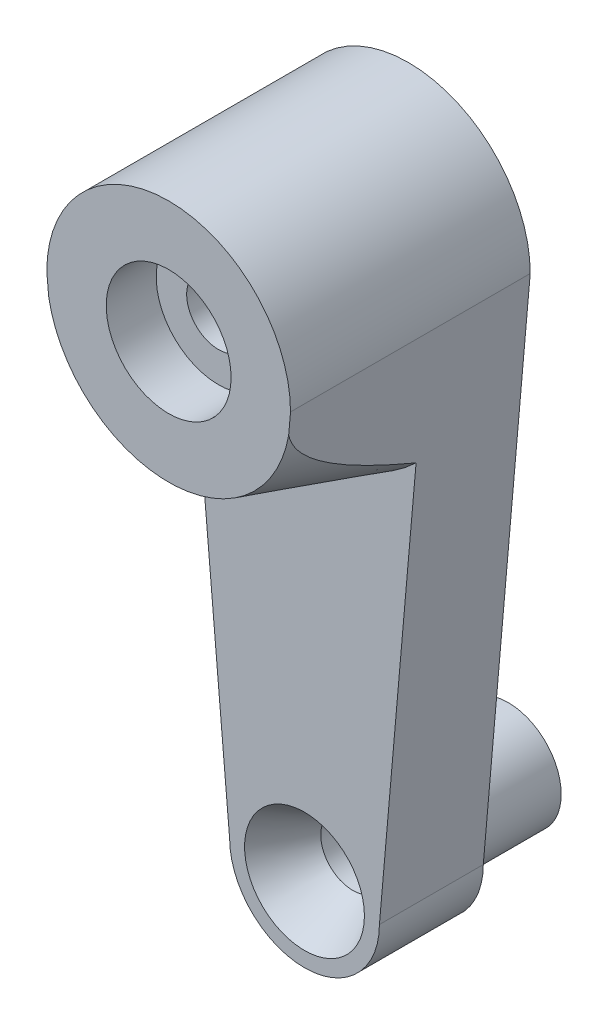
ISO-10303-21;
HEADER;
FILE_DESCRIPTION(('STEP AP214'),'2;1');
FILE_NAME('part.step','',(''),(''),'','','');
FILE_SCHEMA(('AUTOMOTIVE_DESIGN { 1 0 10303 214 1 1 1 1 }'));
ENDSEC;
DATA;
#1=APPLICATION_CONTEXT('core data for automotive mechanical design processes');
#2=APPLICATION_PROTOCOL_DEFINITION('international standard','automotive_design',2000,#1);
#3=PRODUCT_CONTEXT('',#1,'mechanical');
#4=PRODUCT('Part','Part','',(#3));
#5=PRODUCT_RELATED_PRODUCT_CATEGORY('part','',(#4));
#6=PRODUCT_DEFINITION_FORMATION('','',#4);
#7=PRODUCT_DEFINITION_CONTEXT('part definition',#1,'design');
#8=PRODUCT_DEFINITION('design','',#6,#7);
#9=PRODUCT_DEFINITION_SHAPE('','',#8);
#10=(LENGTH_UNIT() NAMED_UNIT(*) SI_UNIT(.MILLI.,.METRE.));
#11=(NAMED_UNIT(*) PLANE_ANGLE_UNIT() SI_UNIT($,.RADIAN.));
#12=(NAMED_UNIT(*) SI_UNIT($,.STERADIAN.) SOLID_ANGLE_UNIT());
#13=UNCERTAINTY_MEASURE_WITH_UNIT(LENGTH_MEASURE(1.E-05),#10,'distance_accuracy_value','');
#14=(GEOMETRIC_REPRESENTATION_CONTEXT(3) GLOBAL_UNCERTAINTY_ASSIGNED_CONTEXT((#13)) GLOBAL_UNIT_ASSIGNED_CONTEXT((#10,
#11,#12)) REPRESENTATION_CONTEXT('',''));
#15=CARTESIAN_POINT('',(0.,0.,0.));
#16=DIRECTION('',(0.,0.,1.));
#17=DIRECTION('',(1.,0.,0.));
#18=AXIS2_PLACEMENT_3D('',#15,#16,#17);
#19=CARTESIAN_POINT('',(0.,0.,12.));
#20=DIRECTION('',(0.,0.,-1.));
#21=DIRECTION('',(-1.,0.,0.));
#22=AXIS2_PLACEMENT_3D('',#19,#20,#21);
#23=CYLINDRICAL_SURFACE('',#22,1.6);
#24=CARTESIAN_POINT('',(0.,0.,2.5));
#25=DIRECTION('',(0.,0.,-1.));
#26=DIRECTION('',(-1.,0.,0.));
#27=AXIS2_PLACEMENT_3D('',#24,#25,#26);
#28=CIRCLE('',#27,1.6);
#29=CARTESIAN_POINT('',(-1.6,0.,2.5));
#30=VERTEX_POINT('',#29);
#31=EDGE_CURVE('E39',#30,#30,#28,.T.);
#32=ORIENTED_EDGE('',*,*,#31,.T.);
#33=EDGE_LOOP('',(#32));
#34=FACE_BOUND('',#33,.T.);
#35=CARTESIAN_POINT('',(0.,0.,9.5));
#36=DIRECTION('',(0.,0.,1.));
#37=DIRECTION('',(1.,0.,0.));
#38=AXIS2_PLACEMENT_3D('',#35,#36,#37);
#39=CIRCLE('',#38,1.6);
#40=CARTESIAN_POINT('',(1.6,0.,9.5));
#41=VERTEX_POINT('',#40);
#42=EDGE_CURVE('E229',#41,#41,#39,.T.);
#43=ORIENTED_EDGE('',*,*,#42,.T.);
#44=EDGE_LOOP('',(#43));
#45=FACE_BOUND('',#44,.T.);
#46=ADVANCED_FACE('F34',(#34,#45),#23,.F.);
#47=CARTESIAN_POINT('',(0.,-26.8,12.));
#48=DIRECTION('',(0.,0.,-1.));
#49=DIRECTION('',(-1.,0.,0.));
#50=AXIS2_PLACEMENT_3D('',#47,#48,#49);
#51=CYLINDRICAL_SURFACE('',#50,3.75);
#52=CARTESIAN_POINT('',(0.,-26.8,5.2));
#53=DIRECTION('',(0.,0.,1.));
#54=DIRECTION('',(1.,0.,0.));
#55=AXIS2_PLACEMENT_3D('',#52,#53,#54);
#56=CIRCLE('',#55,3.75);
#57=CARTESIAN_POINT('',(-3.75,-26.8,5.2));
#58=VERTEX_POINT('',#57);
#59=CARTESIAN_POINT('',(3.75,-26.8,5.2));
#60=VERTEX_POINT('',#59);
#61=EDGE_CURVE('E91',#58,#60,#56,.T.);
#62=ORIENTED_EDGE('',*,*,#61,.F.);
#63=DIRECTION('',(0.,0.,-1.));
#64=VECTOR('',#63,1.);
#65=CARTESIAN_POINT('',(-3.75,-26.8,12.));
#66=LINE('',#65,#64);
#67=CARTESIAN_POINT('',(-3.75,-26.8,0.));
#68=VERTEX_POINT('',#67);
#69=EDGE_CURVE('E101',#58,#68,#66,.T.);
#70=ORIENTED_EDGE('',*,*,#69,.T.);
#71=CARTESIAN_POINT('',(0.,-26.8,0.));
#72=DIRECTION('',(0.,0.,1.));
#73=DIRECTION('',(1.,0.,0.));
#74=AXIS2_PLACEMENT_3D('',#71,#72,#73);
#75=CIRCLE('',#74,3.75);
#76=CARTESIAN_POINT('',(3.75,-26.8,0.));
#77=VERTEX_POINT('',#76);
#78=EDGE_CURVE('E203',#68,#77,#75,.T.);
#79=ORIENTED_EDGE('',*,*,#78,.T.);
#80=DIRECTION('',(0.,0.,-1.));
#81=VECTOR('',#80,1.);
#82=CARTESIAN_POINT('',(3.75,-26.8,12.));
#83=LINE('',#82,#81);
#84=EDGE_CURVE('E103',#60,#77,#83,.T.);
#85=ORIENTED_EDGE('',*,*,#84,.F.);
#86=EDGE_LOOP('',(#62,#70,#79,#85));
#87=FACE_BOUND('',#86,.T.);
#88=ADVANCED_FACE('F99',(#87),#51,.T.);
#89=CARTESIAN_POINT('',(0.,-26.8,12.));
#90=DIRECTION('',(0.,0.,-1.));
#91=DIRECTION('',(-1.,0.,0.));
#92=AXIS2_PLACEMENT_3D('',#89,#90,#91);
#93=CYLINDRICAL_SURFACE('',#92,1.6);
#94=CARTESIAN_POINT('',(0.,-26.8,2.78620689655173));
#95=DIRECTION('',(0.,0.,1.));
#96=DIRECTION('',(1.,0.,0.));
#97=AXIS2_PLACEMENT_3D('',#94,#95,#96);
#98=CIRCLE('',#97,1.6);
#99=CARTESIAN_POINT('',(1.6,-26.8,2.78620689655173));
#100=VERTEX_POINT('',#99);
#101=EDGE_CURVE('E234',#100,#100,#98,.F.);
#102=ORIENTED_EDGE('',*,*,#101,.F.);
#103=EDGE_LOOP('',(#102));
#104=FACE_BOUND('',#103,.T.);
#105=CARTESIAN_POINT('',(0.,-26.8,0.));
#106=DIRECTION('',(0.,0.,1.));
#107=DIRECTION('',(1.,0.,0.));
#108=AXIS2_PLACEMENT_3D('',#105,#106,#107);
#109=CIRCLE('',#108,1.6);
#110=CARTESIAN_POINT('',(1.6,-26.8,0.));
#111=VERTEX_POINT('',#110);
#112=EDGE_CURVE('E201',#111,#111,#109,.T.);
#113=ORIENTED_EDGE('',*,*,#112,.F.);
#114=EDGE_LOOP('',(#113));
#115=FACE_BOUND('',#114,.T.);
#116=ADVANCED_FACE('F154',(#104,#115),#93,.F.);
#117=CARTESIAN_POINT('',(0.,-26.8,12.));
#118=DIRECTION('',(0.,0.,1.));
#119=DIRECTION('',(1.,0.,0.));
#120=AXIS2_PLACEMENT_3D('',#117,#118,#119);
#121=PLANE('',#120);
#122=CARTESIAN_POINT('',(0.,0.,12.));
#123=DIRECTION('',(0.,0.,1.));
#124=DIRECTION('',(1.,0.,0.));
#125=AXIS2_PLACEMENT_3D('',#122,#123,#124);
#126=CIRCLE('',#125,3.125);
#127=CARTESIAN_POINT('',(3.125,0.,12.));
#128=VERTEX_POINT('',#127);
#129=EDGE_CURVE('E190',#128,#128,#126,.T.);
#130=ORIENTED_EDGE('',*,*,#129,.F.);
#131=EDGE_LOOP('',(#130));
#132=FACE_BOUND('',#131,.T.);
#133=CARTESIAN_POINT('',(0.,0.,12.));
#134=DIRECTION('',(0.,0.,-1.));
#135=DIRECTION('',(1.,0.,0.));
#136=AXIS2_PLACEMENT_3D('',#133,#134,#135);
#137=CIRCLE('',#136,6.1);
#138=CARTESIAN_POINT('',(6.00691076147217,-1.06161344363654,12.));
#139=VERTEX_POINT('',#138);
#140=CARTESIAN_POINT('',(-6.00691076147216,-1.06161344363656,12.));
#141=VERTEX_POINT('',#140);
#142=EDGE_CURVE('E95',#139,#141,#137,.T.);
#143=ORIENTED_EDGE('',*,*,#142,.F.);
#144=DIRECTION('',(0.0873513906763996,0.996177561756386,0.));
#145=VECTOR('',#144,1.);
#146=CARTESIAN_POINT('',(6.1,0.,12.));
#147=LINE('',#146,#145);
#148=CARTESIAN_POINT('',(6.1,0.,12.));
#149=VERTEX_POINT('',#148);
#150=EDGE_CURVE('E191',#139,#149,#147,.T.);
#151=ORIENTED_EDGE('',*,*,#150,.T.);
#152=CARTESIAN_POINT('',(0.,0.,12.));
#153=DIRECTION('',(0.,0.,1.));
#154=DIRECTION('',(1.,0.,0.));
#155=AXIS2_PLACEMENT_3D('',#152,#153,#154);
#156=CIRCLE('',#155,6.1);
#157=CARTESIAN_POINT('',(-6.1,0.,12.));
#158=VERTEX_POINT('',#157);
#159=EDGE_CURVE('E117',#149,#158,#156,.T.);
#160=ORIENTED_EDGE('',*,*,#159,.T.);
#161=DIRECTION('',(0.0873513906763996,-0.996177561756386,0.));
#162=VECTOR('',#161,1.);
#163=CARTESIAN_POINT('',(-3.75,-26.8,12.));
#164=LINE('',#163,#162);
#165=EDGE_CURVE('E112',#158,#141,#164,.T.);
#166=ORIENTED_EDGE('',*,*,#165,.T.);
#167=EDGE_LOOP('',(#143,#151,#160,#166));
#168=FACE_BOUND('',#167,.T.);
#169=ADVANCED_FACE('F178',(#132,#168),#121,.T.);
#170=CARTESIAN_POINT('',(0.,-26.8,0.));
#171=DIRECTION('',(0.,0.,1.));
#172=DIRECTION('',(1.,0.,0.));
#173=AXIS2_PLACEMENT_3D('',#170,#171,#172);
#174=PLANE('',#173);
#175=CARTESIAN_POINT('',(0.,0.,0.));
#176=DIRECTION('',(0.,0.,-1.));
#177=DIRECTION('',(-1.,0.,0.));
#178=AXIS2_PLACEMENT_3D('',#175,#176,#177);
#179=CIRCLE('',#178,3.125);
#180=CARTESIAN_POINT('',(-3.125,0.,0.));
#181=VERTEX_POINT('',#180);
#182=EDGE_CURVE('E221',#181,#181,#179,.T.);
#183=ORIENTED_EDGE('',*,*,#182,.F.);
#184=EDGE_LOOP('',(#183));
#185=FACE_BOUND('',#184,.T.);
#186=CARTESIAN_POINT('',(0.,-26.8,0.));
#187=DIRECTION('',(0.,0.,1.));
#188=DIRECTION('',(1.,0.,0.));
#189=AXIS2_PLACEMENT_3D('',#186,#187,#188);
#190=CIRCLE('',#189,3.15);
#191=CARTESIAN_POINT('',(3.15,-26.8,0.));
#192=VERTEX_POINT('',#191);
#193=EDGE_CURVE('E128',#192,#192,#190,.T.);
#194=ORIENTED_EDGE('',*,*,#193,.T.);
#195=EDGE_LOOP('',(#194));
#196=FACE_BOUND('',#195,.T.);
#197=ORIENTED_EDGE('',*,*,#78,.F.);
#198=DIRECTION('',(0.0873513906763996,-0.996177561756386,0.));
#199=VECTOR('',#198,1.);
#200=CARTESIAN_POINT('',(-3.75,-26.8,0.));
#201=LINE('',#200,#199);
#202=CARTESIAN_POINT('',(-6.1,0.,0.));
#203=VERTEX_POINT('',#202);
#204=EDGE_CURVE('E109',#203,#68,#201,.T.);
#205=ORIENTED_EDGE('',*,*,#204,.F.);
#206=CARTESIAN_POINT('',(0.,0.,0.));
#207=DIRECTION('',(0.,0.,1.));
#208=DIRECTION('',(1.,0.,0.));
#209=AXIS2_PLACEMENT_3D('',#206,#207,#208);
#210=CIRCLE('',#209,6.1);
#211=CARTESIAN_POINT('',(6.1,0.,0.));
#212=VERTEX_POINT('',#211);
#213=EDGE_CURVE('E199',#212,#203,#210,.T.);
#214=ORIENTED_EDGE('',*,*,#213,.F.);
#215=DIRECTION('',(0.0873513906763996,0.996177561756386,0.));
#216=VECTOR('',#215,1.);
#217=CARTESIAN_POINT('',(6.1,0.,0.));
#218=LINE('',#217,#216);
#219=EDGE_CURVE('E205',#77,#212,#218,.T.);
#220=ORIENTED_EDGE('',*,*,#219,.F.);
#221=EDGE_LOOP('',(#197,#205,#214,#220));
#222=FACE_BOUND('',#221,.T.);
#223=ADVANCED_FACE('F145',(#185,#196,#222),#174,.F.);
#224=CARTESIAN_POINT('',(6.1,0.,12.));
#225=DIRECTION('',(-0.996177561756386,0.0873513906763996,0.));
#226=DIRECTION('',(-0.0873513906763996,-0.996177561756386,0.));
#227=AXIS2_PLACEMENT_3D('',#224,#225,#226);
#228=PLANE('',#227);
#229=ORIENTED_EDGE('',*,*,#150,.F.);
#230=CARTESIAN_POINT('',(6.00691076147217,-1.06161344363654,11.9999999999999));
#231=CARTESIAN_POINT('',(5.99959290657591,-1.14506812926192,11.9751362120785));
#232=CARTESIAN_POINT('',(5.99243235980993,-1.22672883280593,11.9449550579355));
#233=CARTESIAN_POINT('',(5.97847258999629,-1.38592961195724,11.8758799471729));
#234=CARTESIAN_POINT('',(5.9716719683851,-1.4634856371401,11.8370233346673));
#235=CARTESIAN_POINT('',(5.95206059900039,-1.68713870076145,11.7116434654855));
#236=CARTESIAN_POINT('',(5.93974067235911,-1.8276382896918,11.6151440803783));
#237=CARTESIAN_POINT('',(5.91544789226449,-2.10467935630285,11.3977095441892));
#238=CARTESIAN_POINT('',(5.90356521581586,-2.24019243239791,11.2755087663683));
#239=CARTESIAN_POINT('',(5.88086373731854,-2.49908588930344,11.0186654610849));
#240=CARTESIAN_POINT('',(5.87004637830578,-2.6224498133639,10.8840065241381));
#241=CARTESIAN_POINT('',(5.84895494164729,-2.86298194206493,10.6024445651832));
#242=CARTESIAN_POINT('',(5.83870594811579,-2.97986408106249,10.4552988427259));
#243=CARTESIAN_POINT('',(5.81891825837843,-3.20552794700341,10.155098552462));
#244=CARTESIAN_POINT('',(5.80937907159271,-3.31431526864486,10.0020481788366));
#245=CARTESIAN_POINT('',(5.7887895818787,-3.54912306623438,9.65686973716202));
#246=CARTESIAN_POINT('',(5.77787859154305,-3.67355478580692,9.46365880553206));
#247=CARTESIAN_POINT('',(5.75670729540617,-3.91499765238915,9.07259651436448));
#248=CARTESIAN_POINT('',(5.74644714893255,-4.03200698238626,8.87474403468242));
#249=CARTESIAN_POINT('',(5.72643438988905,-4.2602375961589,8.47533693525278));
#250=CARTESIAN_POINT('',(5.71668253596197,-4.3714502281784,8.27377735671162));
#251=CARTESIAN_POINT('',(5.69760506355262,-4.58901459437861,7.8680295003107));
#252=CARTESIAN_POINT('',(5.68827946630312,-4.69536608641544,7.66384109215117));
#253=CARTESIAN_POINT('',(5.6708452773313,-4.89419002873235,7.27275622565567));
#254=CARTESIAN_POINT('',(5.66270485526182,-4.9870254804184,7.08604509495847));
#255=CARTESIAN_POINT('',(5.64667240975651,-5.16986358235131,6.71122496150825));
#256=CARTESIAN_POINT('',(5.63878039452783,-5.2598661390017,6.52311591282248));
#257=CARTESIAN_POINT('',(5.62323767587374,-5.43711927088674,6.14638500444435));
#258=CARTESIAN_POINT('',(5.61558623934931,-5.5243782065696,5.95776709992486));
#259=CARTESIAN_POINT('',(5.60047114905192,-5.69675455549296,5.57956788235996));
#260=CARTESIAN_POINT('',(5.59300747820272,-5.7818721634754,5.38998665882174));
#261=CARTESIAN_POINT('',(5.58562427825302,-5.86607206077406,5.20000000000024));
#262=B_SPLINE_CURVE_WITH_KNOTS('',3,(#230,#231,#232,#233,#234,#235,#236,#237,#238,#239,#240,
#241,#242,#243,#244,#245,#246,#247,#248,#249,#250,#251,#252,#253,#254,#255,#256,#257,#258,#259,
#260,#261),.UNSPECIFIED.,.F.,.F.,(4,2,2,2,2,2,2,2,2,2,2,2,2,2,2,4),(0.,0.261662991599173,
0.52222063880498,1.03265787208609,1.58016338965039,2.12840061963556,2.69264497011371,
3.25649565177873,3.94647814488238,4.63662890007614,5.32778184670856,6.01896918372795,
6.64497054759159,7.27099257234815,7.89487319806591,8.51869687865688),.UNSPECIFIED.);
#263=CARTESIAN_POINT('',(5.58562427825305,-5.8660720607737,5.2));
#264=VERTEX_POINT('',#263);
#265=EDGE_CURVE('E11',#139,#264,#262,.T.);
#266=ORIENTED_EDGE('',*,*,#265,.T.);
#267=DIRECTION('',(0.0873513906763995,0.996177561756386,0.));
#268=VECTOR('',#267,1.);
#269=CARTESIAN_POINT('',(3.75,-26.8,5.2));
#270=LINE('',#269,#268);
#271=EDGE_CURVE('E104',#60,#264,#270,.T.);
#272=ORIENTED_EDGE('',*,*,#271,.F.);
#273=ORIENTED_EDGE('',*,*,#84,.T.);
#274=ORIENTED_EDGE('',*,*,#219,.T.);
#275=DIRECTION('',(0.,0.,-1.));
#276=VECTOR('',#275,1.);
#277=CARTESIAN_POINT('',(6.1,0.,12.));
#278=LINE('',#277,#276);
#279=EDGE_CURVE('E114',#149,#212,#278,.T.);
#280=ORIENTED_EDGE('',*,*,#279,.F.);
#281=EDGE_LOOP('',(#229,#266,#272,#273,#274,#280));
#282=FACE_BOUND('',#281,.T.);
#283=ADVANCED_FACE('F148',(#282),#228,.F.);
#284=CARTESIAN_POINT('',(0.,0.,12.));
#285=DIRECTION('',(0.,0.,-1.));
#286=DIRECTION('',(-1.,0.,0.));
#287=AXIS2_PLACEMENT_3D('',#284,#285,#286);
#288=CYLINDRICAL_SURFACE('',#287,6.1);
#289=ORIENTED_EDGE('',*,*,#213,.T.);
#290=DIRECTION('',(0.,0.,-1.));
#291=VECTOR('',#290,1.);
#292=CARTESIAN_POINT('',(-6.1,0.,12.));
#293=LINE('',#292,#291);
#294=EDGE_CURVE('E111',#158,#203,#293,.T.);
#295=ORIENTED_EDGE('',*,*,#294,.F.);
#296=ORIENTED_EDGE('',*,*,#159,.F.);
#297=ORIENTED_EDGE('',*,*,#279,.T.);
#298=EDGE_LOOP('',(#289,#295,#296,#297));
#299=FACE_BOUND('',#298,.T.);
#300=ADVANCED_FACE('F144',(#299),#288,.T.);
#301=CARTESIAN_POINT('',(-3.75,-26.8,12.));
#302=DIRECTION('',(0.996177561756386,0.0873513906763996,0.));
#303=DIRECTION('',(-0.0873513906763996,0.996177561756386,0.));
#304=AXIS2_PLACEMENT_3D('',#301,#302,#303);
#305=PLANE('',#304);
#306=DIRECTION('',(0.0873513906763995,-0.996177561756386,0.));
#307=VECTOR('',#306,1.);
#308=CARTESIAN_POINT('',(-6.00691076147216,-1.06161344363656,5.2));
#309=LINE('',#308,#307);
#310=CARTESIAN_POINT('',(-5.58562427825305,-5.8660720607737,5.2));
#311=VERTEX_POINT('',#310);
#312=EDGE_CURVE('E88',#311,#58,#309,.T.);
#313=ORIENTED_EDGE('',*,*,#312,.F.);
#314=CARTESIAN_POINT('',(-5.58562427825305,-5.8660720607737,5.2));
#315=CARTESIAN_POINT('',(-5.59434514506542,-5.76661706904114,5.42438378803641));
#316=CARTESIAN_POINT('',(-5.60317723655505,-5.6658936426913,5.6482099576668));
#317=CARTESIAN_POINT('',(-5.62111137486906,-5.46136815042942,6.0945120190318));
#318=CARTESIAN_POINT('',(-5.63021349384723,-5.35756526165707,6.31698753037528));
#319=CARTESIAN_POINT('',(-5.64883791908311,-5.14516756109474,6.76280228207192));
#320=CARTESIAN_POINT('',(-5.65836387432059,-5.03653113540769,6.98612161383689));
#321=CARTESIAN_POINT('',(-5.67779783502799,-4.81490128563824,7.43053231746062));
#322=CARTESIAN_POINT('',(-5.68770578142968,-4.70190853518497,7.65162402716584));
#323=CARTESIAN_POINT('',(-5.70944460822561,-4.45399340406539,8.12258803313072));
#324=CARTESIAN_POINT('',(-5.72134719457467,-4.31825327038247,8.37202973582075));
#325=CARTESIAN_POINT('',(-5.74592887524451,-4.03791750784986,8.8658148206902));
#326=CARTESIAN_POINT('',(-5.75860783474846,-3.89332341648568,9.11015907821424));
#327=CARTESIAN_POINT('',(-5.78492773967149,-3.59316450076773,9.5903980811787));
#328=CARTESIAN_POINT('',(-5.79856356008484,-3.43765812328772,9.82632895510298));
#329=CARTESIAN_POINT('',(-5.82005604182989,-3.19255237402503,10.1715965643726));
#330=CARTESIAN_POINT('',(-5.82738966543826,-3.10891785798065,10.2851966762799));
#331=CARTESIAN_POINT('',(-5.84247287612226,-2.93690507230785,10.5087045190115));
#332=CARTESIAN_POINT('',(-5.85022235559141,-2.84852802985116,10.618613193175));
#333=CARTESIAN_POINT('',(-5.86426811239864,-2.68834663307086,10.8073280879161));
#334=CARTESIAN_POINT('',(-5.87045726070186,-2.61776400561279,10.8871765191717));
#335=CARTESIAN_POINT('',(-5.8831677593808,-2.47281023344453,11.0433959123622));
#336=CARTESIAN_POINT('',(-5.88968921146913,-2.39843792877759,11.1197657958603));
#337=CARTESIAN_POINT('',(-5.90299024397506,-2.24674955807158,11.2666520827408));
#338=CARTESIAN_POINT('',(-5.90976284096291,-2.16951313284849,11.337250492682));
#339=CARTESIAN_POINT('',(-5.92372477329437,-2.01028769179191,11.4727950199505));
#340=CARTESIAN_POINT('',(-5.93091404616239,-1.92829938844593,11.5377419810112));
#341=CARTESIAN_POINT('',(-5.94870707155432,-1.72538318397623,11.6845235089405));
#342=CARTESIAN_POINT('',(-5.95953838451033,-1.60186012558435,11.7629036495741));
#343=CARTESIAN_POINT('',(-5.97661485014044,-1.40711575158983,11.8650859117111));
#344=CARTESIAN_POINT('',(-5.98249946016059,-1.34000615646648,11.8967857182709));
#345=CARTESIAN_POINT('',(-5.99452181082918,-1.20290019990554,11.9536316168876));
#346=CARTESIAN_POINT('',(-6.00066016580246,-1.13289683255065,11.9787605767453));
#347=CARTESIAN_POINT('',(-6.00691076147217,-1.06161344363656,11.9999999999999));
#348=B_SPLINE_CURVE_WITH_KNOTS('',3,(#314,#315,#316,#317,#318,#319,#320,#321,#322,#323,#324,
#325,#326,#327,#328,#329,#330,#331,#332,#333,#334,#335,#336,#337,#338,#339,#340,#341,#342,#343,
#344,#345,#346,#347),.UNSPECIFIED.,.F.,.F.,(4,2,2,2,2,2,2,2,2,2,2,2,2,2,2,2,4),(0.,
0.736784059763207,1.47376680038016,2.21929708987835,2.96471255498132,3.81726327417892,
4.66966636589723,5.51780892800881,5.94148519066734,6.36505234697997,6.68520778289739,
7.00546180866915,7.31980647767319,7.63410413576224,8.07247337169371,8.29552192933699,
8.51914637094483),.UNSPECIFIED.);
#349=EDGE_CURVE('E44',#311,#141,#348,.T.);
#350=ORIENTED_EDGE('',*,*,#349,.T.);
#351=ORIENTED_EDGE('',*,*,#165,.F.);
#352=ORIENTED_EDGE('',*,*,#294,.T.);
#353=ORIENTED_EDGE('',*,*,#204,.T.);
#354=ORIENTED_EDGE('',*,*,#69,.F.);
#355=EDGE_LOOP('',(#313,#350,#351,#352,#353,#354));
#356=FACE_BOUND('',#355,.T.);
#357=ADVANCED_FACE('F106',(#356),#305,.F.);
#358=CARTESIAN_POINT('',(0.,0.,5.2));
#359=DIRECTION('',(0.,0.,1.));
#360=DIRECTION('',(1.,0.,0.));
#361=AXIS2_PLACEMENT_3D('',#358,#359,#360);
#362=PLANE('',#361);
#363=CARTESIAN_POINT('',(0.,-26.8,5.2));
#364=DIRECTION('',(0.,0.,1.));
#365=DIRECTION('',(1.,0.,0.));
#366=AXIS2_PLACEMENT_3D('',#363,#364,#365);
#367=CIRCLE('',#366,3.);
#368=CARTESIAN_POINT('',(3.,-26.8,5.2));
#369=VERTEX_POINT('',#368);
#370=EDGE_CURVE('E237',#369,#369,#367,.T.);
#371=ORIENTED_EDGE('',*,*,#370,.F.);
#372=EDGE_LOOP('',(#371));
#373=FACE_BOUND('',#372,.T.);
#374=ORIENTED_EDGE('',*,*,#271,.T.);
#375=CARTESIAN_POINT('',(0.,0.,5.2));
#376=DIRECTION('',(0.,0.,1.));
#377=DIRECTION('',(1.,0.,0.));
#378=AXIS2_PLACEMENT_3D('',#375,#376,#377);
#379=CIRCLE('',#378,8.09999999999998);
#380=EDGE_CURVE('E92',#264,#311,#379,.F.);
#381=ORIENTED_EDGE('',*,*,#380,.T.);
#382=ORIENTED_EDGE('',*,*,#312,.T.);
#383=ORIENTED_EDGE('',*,*,#61,.T.);
#384=EDGE_LOOP('',(#374,#381,#382,#383));
#385=FACE_BOUND('',#384,.T.);
#386=ADVANCED_FACE('F90',(#373,#385),#362,.T.);
#387=CARTESIAN_POINT('',(0.,-26.8,0.));
#388=DIRECTION('',(0.,0.,-1.));
#389=DIRECTION('',(-1.,0.,0.));
#390=AXIS2_PLACEMENT_3D('',#387,#388,#389);
#391=PLANE('',#390);
#392=CARTESIAN_POINT('',(0.,-26.8,0.));
#393=DIRECTION('',(0.,0.,-1.));
#394=DIRECTION('',(-1.,0.,0.));
#395=AXIS2_PLACEMENT_3D('',#392,#393,#394);
#396=CIRCLE('',#395,1.55);
#397=CARTESIAN_POINT('',(-1.55,-26.8,0.));
#398=VERTEX_POINT('',#397);
#399=EDGE_CURVE('E216',#398,#398,#396,.T.);
#400=ORIENTED_EDGE('',*,*,#399,.T.);
#401=EDGE_LOOP('',(#400));
#402=FACE_BOUND('',#401,.T.);
#403=ORIENTED_EDGE('',*,*,#112,.T.);
#404=EDGE_LOOP('',(#403));
#405=FACE_BOUND('',#404,.T.);
#406=ADVANCED_FACE('F244',(#402,#405),#391,.F.);
#407=CARTESIAN_POINT('',(0.,-26.8,-5.));
#408=DIRECTION('',(0.,0.,-1.));
#409=DIRECTION('',(-1.,0.,0.));
#410=AXIS2_PLACEMENT_3D('',#407,#408,#409);
#411=PLANE('',#410);
#412=CARTESIAN_POINT('',(0.,-26.8,-5.));
#413=DIRECTION('',(0.,0.,-1.));
#414=DIRECTION('',(-1.,0.,0.));
#415=AXIS2_PLACEMENT_3D('',#412,#413,#414);
#416=CIRCLE('',#415,2.65);
#417=CARTESIAN_POINT('',(-2.65,-26.8,-5.));
#418=VERTEX_POINT('',#417);
#419=EDGE_CURVE('E194',#418,#418,#416,.T.);
#420=ORIENTED_EDGE('',*,*,#419,.T.);
#421=EDGE_LOOP('',(#420));
#422=FACE_BOUND('',#421,.T.);
#423=CARTESIAN_POINT('',(0.,-26.8,-5.));
#424=DIRECTION('',(0.,0.,-1.));
#425=DIRECTION('',(-1.,0.,0.));
#426=AXIS2_PLACEMENT_3D('',#423,#424,#425);
#427=CIRCLE('',#426,1.55);
#428=CARTESIAN_POINT('',(-1.55,-26.8,-5.));
#429=VERTEX_POINT('',#428);
#430=EDGE_CURVE('E215',#429,#429,#427,.T.);
#431=ORIENTED_EDGE('',*,*,#430,.F.);
#432=EDGE_LOOP('',(#431));
#433=FACE_BOUND('',#432,.T.);
#434=ADVANCED_FACE('F248',(#422,#433),#411,.T.);
#435=CARTESIAN_POINT('',(0.,-26.8,-5.));
#436=DIRECTION('',(0.,0.,1.));
#437=DIRECTION('',(1.,0.,0.));
#438=AXIS2_PLACEMENT_3D('',#435,#436,#437);
#439=CYLINDRICAL_SURFACE('',#438,2.65);
#440=CARTESIAN_POINT('',(0.,-26.8,-0.499999999999997));
#441=DIRECTION('',(0.,0.,1.));
#442=DIRECTION('',(1.,0.,0.));
#443=AXIS2_PLACEMENT_3D('',#440,#441,#442);
#444=CIRCLE('',#443,2.65);
#445=CARTESIAN_POINT('',(2.65,-26.8,-0.499999999999997));
#446=VERTEX_POINT('',#445);
#447=EDGE_CURVE('E125',#446,#446,#444,.F.);
#448=ORIENTED_EDGE('',*,*,#447,.T.);
#449=EDGE_LOOP('',(#448));
#450=FACE_BOUND('',#449,.T.);
#451=ORIENTED_EDGE('',*,*,#419,.F.);
#452=EDGE_LOOP('',(#451));
#453=FACE_BOUND('',#452,.T.);
#454=ADVANCED_FACE('F164',(#450,#453),#439,.T.);
#455=CARTESIAN_POINT('',(0.,-26.8,-5.));
#456=DIRECTION('',(0.,0.,1.));
#457=DIRECTION('',(1.,0.,0.));
#458=AXIS2_PLACEMENT_3D('',#455,#456,#457);
#459=CYLINDRICAL_SURFACE('',#458,1.55);
#460=ORIENTED_EDGE('',*,*,#430,.T.);
#461=EDGE_LOOP('',(#460));
#462=FACE_BOUND('',#461,.T.);
#463=ORIENTED_EDGE('',*,*,#399,.F.);
#464=EDGE_LOOP('',(#463));
#465=FACE_BOUND('',#464,.T.);
#466=ADVANCED_FACE('F157',(#462,#465),#459,.F.);
#467=CARTESIAN_POINT('',(0.,-26.8,-0.499999999999997));
#468=DIRECTION('',(0.,0.,1.));
#469=DIRECTION('',(1.,0.,0.));
#470=AXIS2_PLACEMENT_3D('',#467,#468,#469);
#471=CONICAL_SURFACE('',#470,2.65,0.785398163397448);
#472=ORIENTED_EDGE('',*,*,#193,.F.);
#473=EDGE_LOOP('',(#472));
#474=FACE_BOUND('',#473,.T.);
#475=ORIENTED_EDGE('',*,*,#447,.F.);
#476=EDGE_LOOP('',(#475));
#477=FACE_BOUND('',#476,.T.);
#478=ADVANCED_FACE('F155',(#474,#477),#471,.T.);
#479=CARTESIAN_POINT('',(0.,0.,5.2));
#480=DIRECTION('',(0.,0.,-1.));
#481=DIRECTION('',(-1.,0.,0.));
#482=AXIS2_PLACEMENT_3D('',#479,#480,#481);
#483=CONICAL_SURFACE('',#482,8.09999999999998,0.286051441717321);
#484=ORIENTED_EDGE('',*,*,#265,.F.);
#485=ORIENTED_EDGE('',*,*,#142,.T.);
#486=ORIENTED_EDGE('',*,*,#349,.F.);
#487=ORIENTED_EDGE('',*,*,#380,.F.);
#488=EDGE_LOOP('',(#484,#485,#486,#487));
#489=FACE_BOUND('',#488,.T.);
#490=ADVANCED_FACE('F36',(#489),#483,.T.);
#491=CARTESIAN_POINT('',(0.,0.,2.5));
#492=DIRECTION('',(0.,0.,-1.));
#493=DIRECTION('',(-1.,0.,0.));
#494=AXIS2_PLACEMENT_3D('',#491,#492,#493);
#495=CYLINDRICAL_SURFACE('',#494,3.125);
#496=CARTESIAN_POINT('',(0.,0.,2.5));
#497=DIRECTION('',(0.,0.,-1.));
#498=DIRECTION('',(-1.,0.,0.));
#499=AXIS2_PLACEMENT_3D('',#496,#497,#498);
#500=CIRCLE('',#499,3.125);
#501=CARTESIAN_POINT('',(-3.125,0.,2.5));
#502=VERTEX_POINT('',#501);
#503=EDGE_CURVE('E224',#502,#502,#500,.T.);
#504=ORIENTED_EDGE('',*,*,#503,.F.);
#505=EDGE_LOOP('',(#504));
#506=FACE_BOUND('',#505,.T.);
#507=ORIENTED_EDGE('',*,*,#182,.T.);
#508=EDGE_LOOP('',(#507));
#509=FACE_BOUND('',#508,.T.);
#510=ADVANCED_FACE('F163',(#506,#509),#495,.F.);
#511=CARTESIAN_POINT('',(0.,0.,2.5));
#512=DIRECTION('',(0.,0.,-1.));
#513=DIRECTION('',(-1.,0.,0.));
#514=AXIS2_PLACEMENT_3D('',#511,#512,#513);
#515=PLANE('',#514);
#516=ORIENTED_EDGE('',*,*,#31,.F.);
#517=EDGE_LOOP('',(#516));
#518=FACE_BOUND('',#517,.T.);
#519=ORIENTED_EDGE('',*,*,#503,.T.);
#520=EDGE_LOOP('',(#519));
#521=FACE_BOUND('',#520,.T.);
#522=ADVANCED_FACE('F260',(#518,#521),#515,.T.);
#523=CARTESIAN_POINT('',(0.,0.,9.5));
#524=DIRECTION('',(0.,0.,1.));
#525=DIRECTION('',(1.,0.,0.));
#526=AXIS2_PLACEMENT_3D('',#523,#524,#525);
#527=CYLINDRICAL_SURFACE('',#526,3.125);
#528=CARTESIAN_POINT('',(0.,0.,9.5));
#529=DIRECTION('',(0.,0.,1.));
#530=DIRECTION('',(1.,0.,0.));
#531=AXIS2_PLACEMENT_3D('',#528,#529,#530);
#532=CIRCLE('',#531,3.125);
#533=CARTESIAN_POINT('',(3.125,0.,9.5));
#534=VERTEX_POINT('',#533);
#535=EDGE_CURVE('E225',#534,#534,#532,.T.);
#536=ORIENTED_EDGE('',*,*,#535,.F.);
#537=EDGE_LOOP('',(#536));
#538=FACE_BOUND('',#537,.T.);
#539=ORIENTED_EDGE('',*,*,#129,.T.);
#540=EDGE_LOOP('',(#539));
#541=FACE_BOUND('',#540,.T.);
#542=ADVANCED_FACE('F264',(#538,#541),#527,.F.);
#543=CARTESIAN_POINT('',(0.,0.,9.5));
#544=DIRECTION('',(0.,0.,1.));
#545=DIRECTION('',(1.,0.,0.));
#546=AXIS2_PLACEMENT_3D('',#543,#544,#545);
#547=PLANE('',#546);
#548=ORIENTED_EDGE('',*,*,#42,.F.);
#549=EDGE_LOOP('',(#548));
#550=FACE_BOUND('',#549,.T.);
#551=ORIENTED_EDGE('',*,*,#535,.T.);
#552=EDGE_LOOP('',(#551));
#553=FACE_BOUND('',#552,.T.);
#554=ADVANCED_FACE('F268',(#550,#553),#547,.T.);
#555=CARTESIAN_POINT('',(0.,-26.8,5.2));
#556=DIRECTION('',(0.,0.,1.));
#557=DIRECTION('',(1.,0.,0.));
#558=AXIS2_PLACEMENT_3D('',#555,#556,#557);
#559=CONICAL_SURFACE('',#558,3.,0.525583793551611);
#560=ORIENTED_EDGE('',*,*,#101,.T.);
#561=EDGE_LOOP('',(#560));
#562=FACE_BOUND('',#561,.T.);
#563=ORIENTED_EDGE('',*,*,#370,.T.);
#564=EDGE_LOOP('',(#563));
#565=FACE_BOUND('',#564,.T.);
#566=ADVANCED_FACE('F241',(#562,#565),#559,.F.);
#567=CLOSED_SHELL('',(#46,#88,#116,#169,#223,#283,#300,#357,#386,#406,#434,#454,#466,#478,#490,
#510,#522,#542,#554,#566));
#568=MANIFOLD_SOLID_BREP('B2',#567);
#569=ADVANCED_BREP_SHAPE_REPRESENTATION('',(#18,#568),#14);
#570=SHAPE_DEFINITION_REPRESENTATION(#9,#569);
ENDSEC;
END-ISO-10303-21;
